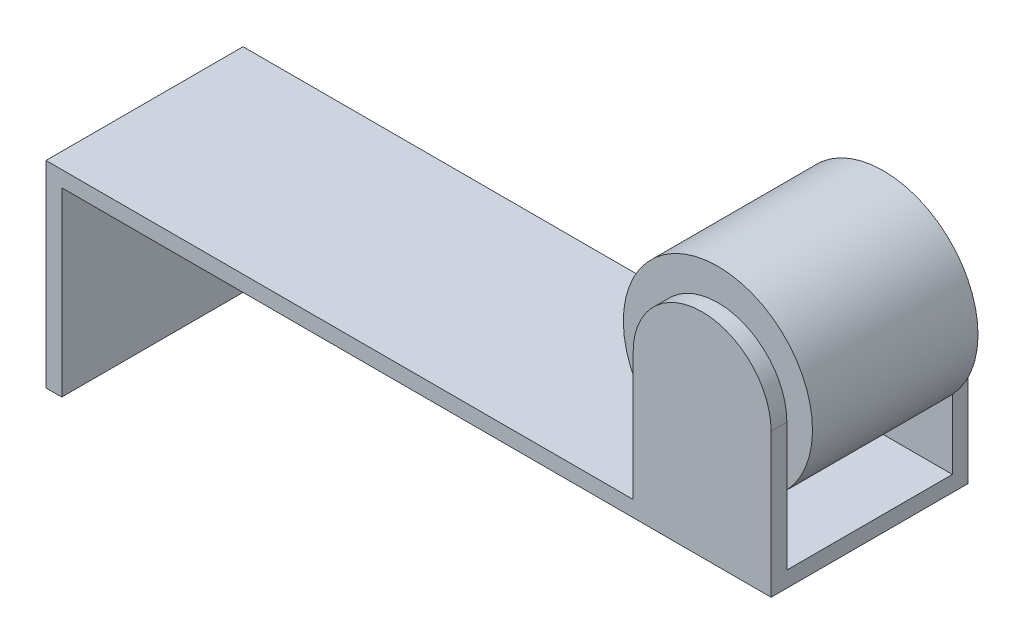
ISO-10303-21;
HEADER;
FILE_DESCRIPTION(('STEP AP214'),'2;1');
FILE_NAME('part.step','',(''),(''),'','','');
FILE_SCHEMA(('AUTOMOTIVE_DESIGN { 1 0 10303 214 1 1 1 1 }'));
ENDSEC;
DATA;
#1=APPLICATION_CONTEXT('core data for automotive mechanical design processes');
#2=APPLICATION_PROTOCOL_DEFINITION('international standard','automotive_design',2000,#1);
#3=PRODUCT_CONTEXT('',#1,'mechanical');
#4=PRODUCT('Part','Part','',(#3));
#5=PRODUCT_RELATED_PRODUCT_CATEGORY('part','',(#4));
#6=PRODUCT_DEFINITION_FORMATION('','',#4);
#7=PRODUCT_DEFINITION_CONTEXT('part definition',#1,'design');
#8=PRODUCT_DEFINITION('design','',#6,#7);
#9=PRODUCT_DEFINITION_SHAPE('','',#8);
#10=(LENGTH_UNIT() NAMED_UNIT(*) SI_UNIT(.MILLI.,.METRE.));
#11=(NAMED_UNIT(*) PLANE_ANGLE_UNIT() SI_UNIT($,.RADIAN.));
#12=(NAMED_UNIT(*) SI_UNIT($,.STERADIAN.) SOLID_ANGLE_UNIT());
#13=UNCERTAINTY_MEASURE_WITH_UNIT(LENGTH_MEASURE(1.E-05),#10,'distance_accuracy_value','');
#14=(GEOMETRIC_REPRESENTATION_CONTEXT(3) GLOBAL_UNCERTAINTY_ASSIGNED_CONTEXT((#13)) GLOBAL_UNIT_ASSIGNED_CONTEXT((#10,
#11,#12)) REPRESENTATION_CONTEXT('',''));
#15=CARTESIAN_POINT('',(0.,0.,0.));
#16=DIRECTION('',(0.,0.,1.));
#17=DIRECTION('',(1.,0.,0.));
#18=AXIS2_PLACEMENT_3D('',#15,#16,#17);
#19=CARTESIAN_POINT('',(16.6500000000001,8.25000000000001,-0.399999999999942));
#20=DIRECTION('',(0.,0.,0.999999999999996));
#21=DIRECTION('',(0.999999999999998,0.,0.));
#22=AXIS2_PLACEMENT_3D('',#19,#20,#21);
#23=CYLINDRICAL_SURFACE('',#22,1.75);
#24=DIRECTION('',(0.,0.,-0.999999999999996));
#25=VECTOR('',#24,1.);
#26=CARTESIAN_POINT('',(18.4000000000001,8.24999999999959,-0.399999999999935));
#27=LINE('',#26,#25);
#28=CARTESIAN_POINT('',(18.4000000000001,8.24999999999959,-0.399999999999935));
#29=VERTEX_POINT('',#28);
#30=CARTESIAN_POINT('',(18.4,8.24999999999959,0.));
#31=VERTEX_POINT('',#30);
#32=EDGE_CURVE('E238',#29,#31,#27,.F.);
#33=ORIENTED_EDGE('',*,*,#32,.F.);
#34=CARTESIAN_POINT('',(16.6500000000001,8.25000000000001,-0.399999999999942));
#35=DIRECTION('',(0.,0.,-0.999999999999996));
#36=DIRECTION('',(-0.999999999999998,0.,0.));
#37=AXIS2_PLACEMENT_3D('',#34,#35,#36);
#38=CIRCLE('',#37,1.75);
#39=CARTESIAN_POINT('',(14.9,8.24999999999998,-0.399999999999935));
#40=VERTEX_POINT('',#39);
#41=EDGE_CURVE('E44',#40,#29,#38,.T.);
#42=ORIENTED_EDGE('',*,*,#41,.F.);
#43=DIRECTION('',(0.,0.,-0.999999999999996));
#44=VECTOR('',#43,1.);
#45=CARTESIAN_POINT('',(14.9,8.24999999999998,-0.399999999999935));
#46=LINE('',#45,#44);
#47=CARTESIAN_POINT('',(14.9,8.24999999999998,0.));
#48=VERTEX_POINT('',#47);
#49=EDGE_CURVE('E240',#48,#40,#46,.T.);
#50=ORIENTED_EDGE('',*,*,#49,.F.);
#51=CARTESIAN_POINT('',(16.65,8.25000000000001,0.));
#52=DIRECTION('',(0.,0.,-0.999999999999996));
#53=DIRECTION('',(-0.999999999999998,0.,0.));
#54=AXIS2_PLACEMENT_3D('',#51,#52,#53);
#55=CIRCLE('',#54,1.75);
#56=EDGE_CURVE('E11',#31,#48,#55,.F.);
#57=ORIENTED_EDGE('',*,*,#56,.F.);
#58=EDGE_LOOP('',(#33,#42,#50,#57));
#59=FACE_BOUND('',#58,.T.);
#60=ADVANCED_FACE('F36',(#59),#23,.T.);
#61=CARTESIAN_POINT('',(16.65,8.25000000000001,-5.));
#62=DIRECTION('',(0.,0.,-0.999999999999996));
#63=DIRECTION('',(-0.999999999999998,0.,0.));
#64=AXIS2_PLACEMENT_3D('',#61,#62,#63);
#65=CYLINDRICAL_SURFACE('',#64,1.75);
#66=DIRECTION('',(0.,0.,0.999999999999996));
#67=VECTOR('',#66,1.);
#68=CARTESIAN_POINT('',(18.4,8.24999999999959,-4.99999999999994));
#69=LINE('',#68,#67);
#70=CARTESIAN_POINT('',(18.4,8.24999999999959,-4.99999999999994));
#71=VERTEX_POINT('',#70);
#72=CARTESIAN_POINT('',(18.4000000000001,8.24999999999959,-4.59999999999994));
#73=VERTEX_POINT('',#72);
#74=EDGE_CURVE('E227',#71,#73,#69,.T.);
#75=ORIENTED_EDGE('',*,*,#74,.F.);
#76=CARTESIAN_POINT('',(16.65,8.25000000000001,-5.));
#77=DIRECTION('',(0.,0.,0.999999999999996));
#78=DIRECTION('',(0.999999999999998,0.,0.));
#79=AXIS2_PLACEMENT_3D('',#76,#77,#78);
#80=CIRCLE('',#79,1.75);
#81=CARTESIAN_POINT('',(14.9,8.24999999999998,-4.99999999999994));
#82=VERTEX_POINT('',#81);
#83=EDGE_CURVE('E233',#82,#71,#80,.F.);
#84=ORIENTED_EDGE('',*,*,#83,.F.);
#85=DIRECTION('',(0.,0.,-0.999999999999996));
#86=VECTOR('',#85,1.);
#87=CARTESIAN_POINT('',(14.9,8.24999999999998,-4.99999999999994));
#88=LINE('',#87,#86);
#89=CARTESIAN_POINT('',(14.9,8.24999999999998,-4.59999999999994));
#90=VERTEX_POINT('',#89);
#91=EDGE_CURVE('E230',#90,#82,#88,.T.);
#92=ORIENTED_EDGE('',*,*,#91,.F.);
#93=CARTESIAN_POINT('',(16.6500000000001,8.25000000000001,-4.60000000000001));
#94=DIRECTION('',(0.,0.,-0.999999999999996));
#95=DIRECTION('',(-0.999999999999998,0.,0.));
#96=AXIS2_PLACEMENT_3D('',#93,#94,#95);
#97=CIRCLE('',#96,1.75);
#98=EDGE_CURVE('E235',#73,#90,#97,.F.);
#99=ORIENTED_EDGE('',*,*,#98,.F.);
#100=EDGE_LOOP('',(#75,#84,#92,#99));
#101=FACE_BOUND('',#100,.T.);
#102=ADVANCED_FACE('F266',(#101),#65,.T.);
#103=CARTESIAN_POINT('',(0.,5.,0.));
#104=DIRECTION('',(0.,-0.999999999999998,0.));
#105=DIRECTION('',(0.,0.,-0.999999999999996));
#106=AXIS2_PLACEMENT_3D('',#103,#104,#105);
#107=PLANE('',#106);
#108=DIRECTION('',(0.,0.,-0.999999999999996));
#109=VECTOR('',#108,1.);
#110=CARTESIAN_POINT('',(14.9,5.,0.));
#111=LINE('',#110,#109);
#112=CARTESIAN_POINT('',(14.9,5.,0.));
#113=VERTEX_POINT('',#112);
#114=CARTESIAN_POINT('',(14.9000000000001,5.,-0.399999999999935));
#115=VERTEX_POINT('',#114);
#116=EDGE_CURVE('E451',#113,#115,#111,.T.);
#117=ORIENTED_EDGE('',*,*,#116,.T.);
#118=DIRECTION('',(0.999999999999998,0.,0.));
#119=VECTOR('',#118,1.);
#120=CARTESIAN_POINT('',(18.4,4.99999999999962,-0.399999999999935));
#121=LINE('',#120,#119);
#122=CARTESIAN_POINT('',(18.4,4.99999999999962,-0.399999999999935));
#123=VERTEX_POINT('',#122);
#124=EDGE_CURVE('E158',#115,#123,#121,.T.);
#125=ORIENTED_EDGE('',*,*,#124,.T.);
#126=DIRECTION('',(0.,0.,0.999999999999996));
#127=VECTOR('',#126,1.);
#128=CARTESIAN_POINT('',(18.4,4.99999999999962,0.));
#129=LINE('',#128,#127);
#130=CARTESIAN_POINT('',(18.4,4.99999999999962,-4.59999999999994));
#131=VERTEX_POINT('',#130);
#132=EDGE_CURVE('E162',#131,#123,#129,.T.);
#133=ORIENTED_EDGE('',*,*,#132,.F.);
#134=DIRECTION('',(0.999999999999998,0.,0.));
#135=VECTOR('',#134,1.);
#136=CARTESIAN_POINT('',(18.4,4.99999999999962,-4.59999999999994));
#137=LINE('',#136,#135);
#138=CARTESIAN_POINT('',(14.9,5.,-4.59999999999994));
#139=VERTEX_POINT('',#138);
#140=EDGE_CURVE('E169',#139,#131,#137,.T.);
#141=ORIENTED_EDGE('',*,*,#140,.F.);
#142=DIRECTION('',(0.,0.,0.999999999999996));
#143=VECTOR('',#142,1.);
#144=CARTESIAN_POINT('',(14.9,5.,-4.99999999999994));
#145=LINE('',#144,#143);
#146=CARTESIAN_POINT('',(14.9,5.,-4.99999999999994));
#147=VERTEX_POINT('',#146);
#148=EDGE_CURVE('E146',#147,#139,#145,.T.);
#149=ORIENTED_EDGE('',*,*,#148,.F.);
#150=DIRECTION('',(-0.999999999999998,0.,0.));
#151=VECTOR('',#150,1.);
#152=CARTESIAN_POINT('',(0.,5.,-5.));
#153=LINE('',#152,#151);
#154=CARTESIAN_POINT('',(0.,5.,-5.));
#155=VERTEX_POINT('',#154);
#156=EDGE_CURVE('E206',#147,#155,#153,.T.);
#157=ORIENTED_EDGE('',*,*,#156,.T.);
#158=DIRECTION('',(0.,0.,0.999999999999996));
#159=VECTOR('',#158,1.);
#160=CARTESIAN_POINT('',(0.,5.,0.));
#161=LINE('',#160,#159);
#162=CARTESIAN_POINT('',(0.,5.,0.));
#163=VERTEX_POINT('',#162);
#164=EDGE_CURVE('E199',#155,#163,#161,.T.);
#165=ORIENTED_EDGE('',*,*,#164,.T.);
#166=DIRECTION('',(0.999999999999998,0.,0.));
#167=VECTOR('',#166,1.);
#168=CARTESIAN_POINT('',(0.,5.,0.));
#169=LINE('',#168,#167);
#170=EDGE_CURVE('E202',#163,#113,#169,.T.);
#171=ORIENTED_EDGE('',*,*,#170,.T.);
#172=EDGE_LOOP('',(#117,#125,#133,#141,#149,#157,#165,#171));
#173=FACE_BOUND('',#172,.T.);
#174=ADVANCED_FACE('F278',(#173),#107,.F.);
#175=CARTESIAN_POINT('',(0.400000000000005,5.,2.4980018054066E-13));
#176=DIRECTION('',(-0.999999999999998,0.,0.));
#177=DIRECTION('',(0.,0.,0.999999999999996));
#178=AXIS2_PLACEMENT_3D('',#175,#176,#177);
#179=PLANE('',#178);
#180=DIRECTION('',(0.,0.,-0.999999999999996));
#181=VECTOR('',#180,1.);
#182=CARTESIAN_POINT('',(0.400000000000005,4.59999999999999,2.4980018054066E-13));
#183=LINE('',#182,#181);
#184=CARTESIAN_POINT('',(0.400000000000005,4.59999999999999,2.4980018054066E-13));
#185=VERTEX_POINT('',#184);
#186=CARTESIAN_POINT('',(0.399999999999998,4.59999999999999,-4.99999999999975));
#187=VERTEX_POINT('',#186);
#188=EDGE_CURVE('E181',#185,#187,#183,.T.);
#189=ORIENTED_EDGE('',*,*,#188,.F.);
#190=DIRECTION('',(0.,-0.999999999999998,0.));
#191=VECTOR('',#190,1.);
#192=CARTESIAN_POINT('',(0.400000000000005,5.,2.4980018054066E-13));
#193=LINE('',#192,#191);
#194=CARTESIAN_POINT('',(0.399999999999998,0.,2.4980018054066E-13));
#195=VERTEX_POINT('',#194);
#196=EDGE_CURVE('E222',#185,#195,#193,.T.);
#197=ORIENTED_EDGE('',*,*,#196,.T.);
#198=DIRECTION('',(0.,0.,-0.999999999999996));
#199=VECTOR('',#198,1.);
#200=CARTESIAN_POINT('',(0.399999999999998,0.,2.4980018054066E-13));
#201=LINE('',#200,#199);
#202=CARTESIAN_POINT('',(0.399999999999998,0.,-4.99999999999975));
#203=VERTEX_POINT('',#202);
#204=EDGE_CURVE('E214',#195,#203,#201,.T.);
#205=ORIENTED_EDGE('',*,*,#204,.T.);
#206=DIRECTION('',(0.,-0.999999999999998,0.));
#207=VECTOR('',#206,1.);
#208=CARTESIAN_POINT('',(0.400000000000067,5.,-4.99999999999975));
#209=LINE('',#208,#207);
#210=EDGE_CURVE('E220',#187,#203,#209,.T.);
#211=ORIENTED_EDGE('',*,*,#210,.F.);
#212=EDGE_LOOP('',(#189,#197,#205,#211));
#213=FACE_BOUND('',#212,.T.);
#214=ADVANCED_FACE('F296',(#213),#179,.F.);
#215=CARTESIAN_POINT('',(0.,5.,0.));
#216=DIRECTION('',(0.999999999999998,0.,0.));
#217=DIRECTION('',(0.,0.,-0.999999999999996));
#218=AXIS2_PLACEMENT_3D('',#215,#216,#217);
#219=PLANE('',#218);
#220=DIRECTION('',(0.,0.,0.999999999999996));
#221=VECTOR('',#220,1.);
#222=CARTESIAN_POINT('',(0.,0.,0.));
#223=LINE('',#222,#221);
#224=CARTESIAN_POINT('',(0.,0.,-5.));
#225=VERTEX_POINT('',#224);
#226=CARTESIAN_POINT('',(0.,0.,0.));
#227=VERTEX_POINT('',#226);
#228=EDGE_CURVE('E198',#225,#227,#223,.T.);
#229=ORIENTED_EDGE('',*,*,#228,.T.);
#230=DIRECTION('',(0.,-0.999999999999998,0.));
#231=VECTOR('',#230,1.);
#232=CARTESIAN_POINT('',(0.,5.,0.));
#233=LINE('',#232,#231);
#234=EDGE_CURVE('E224',#163,#227,#233,.T.);
#235=ORIENTED_EDGE('',*,*,#234,.F.);
#236=ORIENTED_EDGE('',*,*,#164,.F.);
#237=DIRECTION('',(0.,-0.999999999999998,0.));
#238=VECTOR('',#237,1.);
#239=CARTESIAN_POINT('',(0.,5.,-5.));
#240=LINE('',#239,#238);
#241=EDGE_CURVE('E208',#155,#225,#240,.T.);
#242=ORIENTED_EDGE('',*,*,#241,.T.);
#243=EDGE_LOOP('',(#229,#235,#236,#242));
#244=FACE_BOUND('',#243,.T.);
#245=ADVANCED_FACE('F302',(#244),#219,.F.);
#246=CARTESIAN_POINT('',(0.,5.,0.));
#247=DIRECTION('',(0.,0.,-0.999999999999996));
#248=DIRECTION('',(-0.999999999999998,0.,0.));
#249=AXIS2_PLACEMENT_3D('',#246,#247,#248);
#250=PLANE('',#249);
#251=DIRECTION('',(0.,-0.999999999999998,0.));
#252=VECTOR('',#251,1.);
#253=CARTESIAN_POINT('',(18.4,4.99999999999962,0.));
#254=LINE('',#253,#252);
#255=CARTESIAN_POINT('',(18.3999999999999,4.5999999999996,0.));
#256=VERTEX_POINT('',#255);
#257=EDGE_CURVE('E182',#31,#256,#254,.T.);
#258=ORIENTED_EDGE('',*,*,#257,.F.);
#259=ORIENTED_EDGE('',*,*,#56,.T.);
#260=DIRECTION('',(0.,-0.999999999999998,0.));
#261=VECTOR('',#260,1.);
#262=CARTESIAN_POINT('',(14.8999999999999,10.,0.));
#263=LINE('',#262,#261);
#264=EDGE_CURVE('E247',#48,#113,#263,.T.);
#265=ORIENTED_EDGE('',*,*,#264,.T.);
#266=ORIENTED_EDGE('',*,*,#170,.F.);
#267=ORIENTED_EDGE('',*,*,#234,.T.);
#268=DIRECTION('',(0.999999999999998,0.,0.));
#269=VECTOR('',#268,1.);
#270=CARTESIAN_POINT('',(0.,0.,0.));
#271=LINE('',#270,#269);
#272=EDGE_CURVE('E211',#227,#195,#271,.T.);
#273=ORIENTED_EDGE('',*,*,#272,.T.);
#274=ORIENTED_EDGE('',*,*,#196,.F.);
#275=DIRECTION('',(-0.999999999999998,0.,0.));
#276=VECTOR('',#275,1.);
#277=CARTESIAN_POINT('',(18.3999999999999,4.5999999999996,0.));
#278=LINE('',#277,#276);
#279=EDGE_CURVE('E195',#256,#185,#278,.T.);
#280=ORIENTED_EDGE('',*,*,#279,.F.);
#281=EDGE_LOOP('',(#258,#259,#265,#266,#267,#273,#274,#280));
#282=FACE_BOUND('',#281,.T.);
#283=ADVANCED_FACE('F253',(#282),#250,.F.);
#284=CARTESIAN_POINT('',(0.,5.,-5.));
#285=DIRECTION('',(0.,0.,0.999999999999996));
#286=DIRECTION('',(0.999999999999998,0.,0.));
#287=AXIS2_PLACEMENT_3D('',#284,#285,#286);
#288=PLANE('',#287);
#289=DIRECTION('',(0.,-0.999999999999998,0.));
#290=VECTOR('',#289,1.);
#291=CARTESIAN_POINT('',(14.8999999999999,10.,-4.99999999999994));
#292=LINE('',#291,#290);
#293=EDGE_CURVE('E179',#82,#147,#292,.T.);
#294=ORIENTED_EDGE('',*,*,#293,.F.);
#295=ORIENTED_EDGE('',*,*,#83,.T.);
#296=DIRECTION('',(0.,0.999999999999998,0.));
#297=VECTOR('',#296,1.);
#298=CARTESIAN_POINT('',(18.4,4.99999999999962,-4.99999999999994));
#299=LINE('',#298,#297);
#300=CARTESIAN_POINT('',(18.4,4.5999999999996,-4.99999999999994));
#301=VERTEX_POINT('',#300);
#302=EDGE_CURVE('E186',#301,#71,#299,.T.);
#303=ORIENTED_EDGE('',*,*,#302,.F.);
#304=DIRECTION('',(-0.999999999999998,0.,0.));
#305=VECTOR('',#304,1.);
#306=CARTESIAN_POINT('',(18.4,4.5999999999996,-4.99999999999994));
#307=LINE('',#306,#305);
#308=EDGE_CURVE('E190',#301,#187,#307,.T.);
#309=ORIENTED_EDGE('',*,*,#308,.T.);
#310=ORIENTED_EDGE('',*,*,#210,.T.);
#311=DIRECTION('',(-0.999999999999998,0.,0.));
#312=VECTOR('',#311,1.);
#313=CARTESIAN_POINT('',(0.,0.,-5.));
#314=LINE('',#313,#312);
#315=EDGE_CURVE('E203',#203,#225,#314,.T.);
#316=ORIENTED_EDGE('',*,*,#315,.T.);
#317=ORIENTED_EDGE('',*,*,#241,.F.);
#318=ORIENTED_EDGE('',*,*,#156,.F.);
#319=EDGE_LOOP('',(#294,#295,#303,#309,#310,#316,#317,#318));
#320=FACE_BOUND('',#319,.T.);
#321=ADVANCED_FACE('F263',(#320),#288,.F.);
#322=CARTESIAN_POINT('',(0.,0.,0.));
#323=DIRECTION('',(0.,-0.999999999999998,0.));
#324=DIRECTION('',(0.,0.,-0.999999999999996));
#325=AXIS2_PLACEMENT_3D('',#322,#323,#324);
#326=PLANE('',#325);
#327=ORIENTED_EDGE('',*,*,#228,.F.);
#328=ORIENTED_EDGE('',*,*,#315,.F.);
#329=ORIENTED_EDGE('',*,*,#204,.F.);
#330=ORIENTED_EDGE('',*,*,#272,.F.);
#331=EDGE_LOOP('',(#327,#328,#329,#330));
#332=FACE_BOUND('',#331,.T.);
#333=ADVANCED_FACE('F313',(#332),#326,.T.);
#334=CARTESIAN_POINT('',(18.3999999999999,4.5999999999996,0.));
#335=DIRECTION('',(0.,0.999999999999998,0.));
#336=DIRECTION('',(0.,0.,0.999999999999996));
#337=AXIS2_PLACEMENT_3D('',#334,#335,#336);
#338=PLANE('',#337);
#339=ORIENTED_EDGE('',*,*,#188,.T.);
#340=ORIENTED_EDGE('',*,*,#308,.F.);
#341=DIRECTION('',(0.,0.,-0.999999999999996));
#342=VECTOR('',#341,1.);
#343=CARTESIAN_POINT('',(18.3999999999999,4.5999999999996,0.));
#344=LINE('',#343,#342);
#345=EDGE_CURVE('E184',#256,#301,#344,.T.);
#346=ORIENTED_EDGE('',*,*,#345,.F.);
#347=ORIENTED_EDGE('',*,*,#279,.T.);
#348=EDGE_LOOP('',(#339,#340,#346,#347));
#349=FACE_BOUND('',#348,.T.);
#350=ADVANCED_FACE('F256',(#349),#338,.F.);
#351=CARTESIAN_POINT('',(18.3999999999999,-2.4980018054066E-13,0.));
#352=DIRECTION('',(0.999999999999998,0.,0.));
#353=DIRECTION('',(0.,0.,-0.999999999999996));
#354=AXIS2_PLACEMENT_3D('',#351,#352,#353);
#355=PLANE('',#354);
#356=DIRECTION('',(0.,-0.999999999999998,0.));
#357=VECTOR('',#356,1.);
#358=CARTESIAN_POINT('',(18.4,9.99999999999962,-0.399999999999935));
#359=LINE('',#358,#357);
#360=CARTESIAN_POINT('',(18.3999999999999,6.75759322943392,-0.399999999999935));
#361=VERTEX_POINT('',#360);
#362=EDGE_CURVE('E137',#29,#361,#359,.T.);
#363=ORIENTED_EDGE('',*,*,#362,.F.);
#364=ORIENTED_EDGE('',*,*,#32,.T.);
#365=ORIENTED_EDGE('',*,*,#257,.T.);
#366=ORIENTED_EDGE('',*,*,#345,.T.);
#367=ORIENTED_EDGE('',*,*,#302,.T.);
#368=ORIENTED_EDGE('',*,*,#74,.T.);
#369=DIRECTION('',(0.,-0.999999999999998,0.));
#370=VECTOR('',#369,1.);
#371=CARTESIAN_POINT('',(18.4,9.99999999999962,-4.59999999999994));
#372=LINE('',#371,#370);
#373=CARTESIAN_POINT('',(18.4,6.75759322943392,-4.59999999999994));
#374=VERTEX_POINT('',#373);
#375=EDGE_CURVE('E173',#73,#374,#372,.T.);
#376=ORIENTED_EDGE('',*,*,#375,.T.);
#377=EDGE_CURVE('E172',#374,#131,#372,.T.);
#378=ORIENTED_EDGE('',*,*,#377,.T.);
#379=ORIENTED_EDGE('',*,*,#132,.T.);
#380=EDGE_CURVE('E147',#361,#123,#359,.T.);
#381=ORIENTED_EDGE('',*,*,#380,.F.);
#382=EDGE_LOOP('',(#363,#364,#365,#366,#367,#368,#376,#378,#379,#381));
#383=FACE_BOUND('',#382,.T.);
#384=ADVANCED_FACE('F160',(#383),#355,.T.);
#385=CARTESIAN_POINT('',(14.8999999999999,10.,-4.99999999999994));
#386=DIRECTION('',(0.999999999999998,0.,0.));
#387=DIRECTION('',(0.,0.,-0.999999999999996));
#388=AXIS2_PLACEMENT_3D('',#385,#386,#387);
#389=PLANE('',#388);
#390=DIRECTION('',(0.,-0.999999999999998,0.));
#391=VECTOR('',#390,1.);
#392=CARTESIAN_POINT('',(14.8999999999999,10.,-4.59999999999994));
#393=LINE('',#392,#391);
#394=CARTESIAN_POINT('',(14.8999999999999,6.75759322943431,-4.59999999999994));
#395=VERTEX_POINT('',#394);
#396=EDGE_CURVE('E176',#90,#395,#393,.T.);
#397=ORIENTED_EDGE('',*,*,#396,.F.);
#398=ORIENTED_EDGE('',*,*,#91,.T.);
#399=ORIENTED_EDGE('',*,*,#293,.T.);
#400=ORIENTED_EDGE('',*,*,#148,.T.);
#401=EDGE_CURVE('E175',#395,#139,#393,.T.);
#402=ORIENTED_EDGE('',*,*,#401,.F.);
#403=EDGE_LOOP('',(#397,#398,#399,#400,#402));
#404=FACE_BOUND('',#403,.T.);
#405=ADVANCED_FACE('F280',(#404),#389,.F.);
#406=CARTESIAN_POINT('',(18.4,9.99999999999962,-4.59999999999994));
#407=DIRECTION('',(0.,0.,-0.999999999999996));
#408=DIRECTION('',(-0.999999999999998,0.,0.));
#409=AXIS2_PLACEMENT_3D('',#406,#407,#408);
#410=PLANE('',#409);
#411=CARTESIAN_POINT('',(16.65,8.40000000000005,-4.60000000000001));
#412=DIRECTION('',(0.,0.,0.999999999999996));
#413=DIRECTION('',(0.999999999999998,0.,0.));
#414=AXIS2_PLACEMENT_3D('',#411,#412,#413);
#415=CIRCLE('',#414,2.4);
#416=EDGE_CURVE('E51',#395,#374,#415,.T.);
#417=ORIENTED_EDGE('',*,*,#416,.F.);
#418=ORIENTED_EDGE('',*,*,#401,.T.);
#419=ORIENTED_EDGE('',*,*,#140,.T.);
#420=ORIENTED_EDGE('',*,*,#377,.F.);
#421=EDGE_LOOP('',(#417,#418,#419,#420));
#422=FACE_BOUND('',#421,.T.);
#423=ADVANCED_FACE('F273',(#422),#410,.F.);
#424=CARTESIAN_POINT('',(18.4,9.99999999999962,-0.399999999999935));
#425=DIRECTION('',(0.,0.,-0.999999999999996));
#426=DIRECTION('',(-0.999999999999998,0.,0.));
#427=AXIS2_PLACEMENT_3D('',#424,#425,#426);
#428=PLANE('',#427);
#429=DIRECTION('',(0.,-0.999999999999998,0.));
#430=VECTOR('',#429,1.);
#431=CARTESIAN_POINT('',(14.8999999999999,10.,-0.399999999999935));
#432=LINE('',#431,#430);
#433=CARTESIAN_POINT('',(14.8999999999999,6.75759322943431,-0.399999999999935));
#434=VERTEX_POINT('',#433);
#435=EDGE_CURVE('E156',#434,#115,#432,.T.);
#436=ORIENTED_EDGE('',*,*,#435,.F.);
#437=CARTESIAN_POINT('',(16.65,8.40000000000005,-0.399999999999942));
#438=DIRECTION('',(0.,0.,-0.999999999999996));
#439=DIRECTION('',(-0.999999999999998,0.,0.));
#440=AXIS2_PLACEMENT_3D('',#437,#438,#439);
#441=CIRCLE('',#440,2.4);
#442=EDGE_CURVE('E58',#361,#434,#441,.T.);
#443=ORIENTED_EDGE('',*,*,#442,.F.);
#444=ORIENTED_EDGE('',*,*,#380,.T.);
#445=ORIENTED_EDGE('',*,*,#124,.F.);
#446=EDGE_LOOP('',(#436,#443,#444,#445));
#447=FACE_BOUND('',#446,.T.);
#448=ADVANCED_FACE('F153',(#447),#428,.T.);
#449=CARTESIAN_POINT('',(14.8999999999999,10.,0.));
#450=DIRECTION('',(-0.999999999999998,0.,0.));
#451=DIRECTION('',(0.,0.,0.999999999999996));
#452=AXIS2_PLACEMENT_3D('',#449,#450,#451);
#453=PLANE('',#452);
#454=ORIENTED_EDGE('',*,*,#264,.F.);
#455=ORIENTED_EDGE('',*,*,#49,.T.);
#456=EDGE_CURVE('E163',#40,#434,#432,.T.);
#457=ORIENTED_EDGE('',*,*,#456,.T.);
#458=ORIENTED_EDGE('',*,*,#435,.T.);
#459=ORIENTED_EDGE('',*,*,#116,.F.);
#460=EDGE_LOOP('',(#454,#455,#457,#458,#459));
#461=FACE_BOUND('',#460,.T.);
#462=ADVANCED_FACE('F245',(#461),#453,.T.);
#463=CARTESIAN_POINT('',(16.65,8.40000000000005,-4.60000000000001));
#464=DIRECTION('',(0.,0.,0.999999999999996));
#465=DIRECTION('',(0.999999999999998,0.,0.));
#466=AXIS2_PLACEMENT_3D('',#463,#464,#465);
#467=PLANE('',#466);
#468=ORIENTED_EDGE('',*,*,#375,.F.);
#469=ORIENTED_EDGE('',*,*,#98,.T.);
#470=ORIENTED_EDGE('',*,*,#396,.T.);
#471=EDGE_CURVE('E272',#374,#395,#415,.T.);
#472=ORIENTED_EDGE('',*,*,#471,.F.);
#473=EDGE_LOOP('',(#468,#469,#470,#472));
#474=FACE_BOUND('',#473,.T.);
#475=ADVANCED_FACE('F269',(#474),#467,.F.);
#476=CARTESIAN_POINT('',(16.65,8.40000000000005,6.38822509939085));
#477=DIRECTION('',(0.,0.,-0.999999999999996));
#478=DIRECTION('',(-0.999999999999998,0.,0.));
#479=AXIS2_PLACEMENT_3D('',#476,#477,#478);
#480=CYLINDRICAL_SURFACE('',#479,2.4);
#481=ORIENTED_EDGE('',*,*,#442,.T.);
#482=EDGE_CURVE('E139',#434,#361,#441,.T.);
#483=ORIENTED_EDGE('',*,*,#482,.T.);
#484=EDGE_LOOP('',(#481,#483));
#485=FACE_BOUND('',#484,.T.);
#486=ORIENTED_EDGE('',*,*,#416,.T.);
#487=ORIENTED_EDGE('',*,*,#471,.T.);
#488=EDGE_LOOP('',(#486,#487));
#489=FACE_BOUND('',#488,.T.);
#490=ADVANCED_FACE('F149',(#485,#489),#480,.T.);
#491=CARTESIAN_POINT('',(18.4,9.99999999999962,-0.399999999999935));
#492=DIRECTION('',(0.,0.,-0.999999999999996));
#493=DIRECTION('',(-0.999999999999998,0.,0.));
#494=AXIS2_PLACEMENT_3D('',#491,#492,#493);
#495=PLANE('',#494);
#496=ORIENTED_EDGE('',*,*,#362,.T.);
#497=ORIENTED_EDGE('',*,*,#482,.F.);
#498=ORIENTED_EDGE('',*,*,#456,.F.);
#499=ORIENTED_EDGE('',*,*,#41,.T.);
#500=EDGE_LOOP('',(#496,#497,#498,#499));
#501=FACE_BOUND('',#500,.T.);
#502=ADVANCED_FACE('F138',(#501),#495,.F.);
#503=CLOSED_SHELL('',(#60,#102,#174,#214,#245,#283,#321,#333,#350,#384,#405,#423,#448,#462,#475,
#490,#502));
#504=MANIFOLD_SOLID_BREP('B2',#503);
#505=ADVANCED_BREP_SHAPE_REPRESENTATION('',(#18,#504),#14);
#506=SHAPE_DEFINITION_REPRESENTATION(#9,#505);
ENDSEC;
END-ISO-10303-21;
